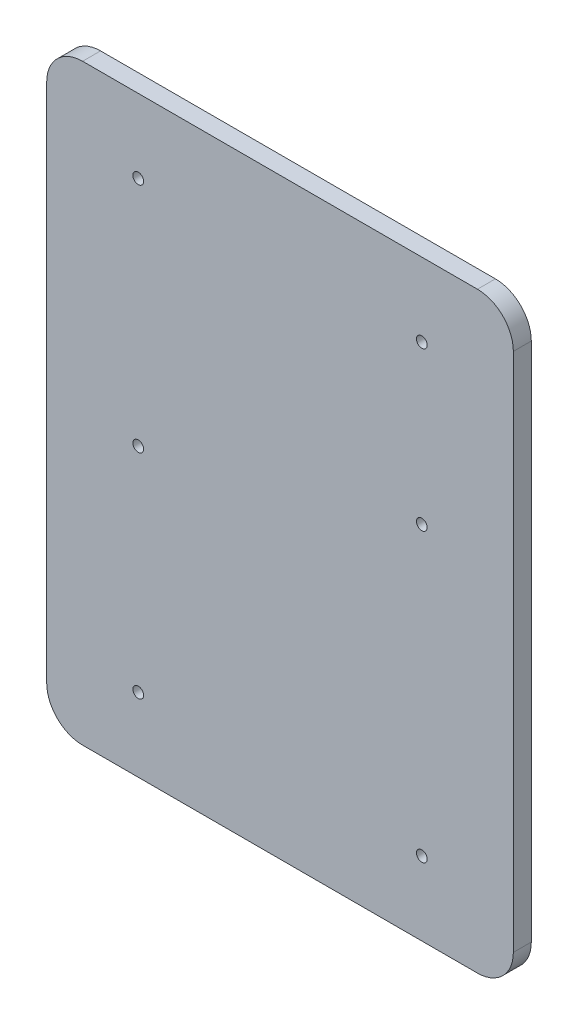
ISO-10303-21;
HEADER;
FILE_DESCRIPTION(('STEP AP214'),'2;1');
FILE_NAME('part.step','',(''),(''),'','','');
FILE_SCHEMA(('AUTOMOTIVE_DESIGN { 1 0 10303 214 1 1 1 1 }'));
ENDSEC;
DATA;
#1=APPLICATION_CONTEXT('core data for automotive mechanical design processes');
#2=APPLICATION_PROTOCOL_DEFINITION('international standard','automotive_design',2000,#1);
#3=PRODUCT_CONTEXT('',#1,'mechanical');
#4=PRODUCT('Part','Part','',(#3));
#5=PRODUCT_RELATED_PRODUCT_CATEGORY('part','',(#4));
#6=PRODUCT_DEFINITION_FORMATION('','',#4);
#7=PRODUCT_DEFINITION_CONTEXT('part definition',#1,'design');
#8=PRODUCT_DEFINITION('design','',#6,#7);
#9=PRODUCT_DEFINITION_SHAPE('','',#8);
#10=(LENGTH_UNIT() NAMED_UNIT(*) SI_UNIT(.MILLI.,.METRE.));
#11=(NAMED_UNIT(*) PLANE_ANGLE_UNIT() SI_UNIT($,.RADIAN.));
#12=(NAMED_UNIT(*) SI_UNIT($,.STERADIAN.) SOLID_ANGLE_UNIT());
#13=UNCERTAINTY_MEASURE_WITH_UNIT(LENGTH_MEASURE(1.E-05),#10,'distance_accuracy_value','');
#14=(GEOMETRIC_REPRESENTATION_CONTEXT(3) GLOBAL_UNCERTAINTY_ASSIGNED_CONTEXT((#13)) GLOBAL_UNIT_ASSIGNED_CONTEXT((#10,
#11,#12)) REPRESENTATION_CONTEXT('',''));
#15=CARTESIAN_POINT('',(0.,0.,0.));
#16=DIRECTION('',(0.,0.,1.));
#17=DIRECTION('',(1.,0.,0.));
#18=AXIS2_PLACEMENT_3D('',#15,#16,#17);
#19=CARTESIAN_POINT('',(-49.2171194490085,118.60614533863,5.));
#20=DIRECTION('',(0.,0.,-1.));
#21=DIRECTION('',(-1.,0.,0.));
#22=AXIS2_PLACEMENT_3D('',#19,#20,#21);
#23=CYLINDRICAL_SURFACE('',#22,10.);
#24=CARTESIAN_POINT('',(-49.2171194490085,118.60614533863,0.));
#25=DIRECTION('',(0.,0.,1.));
#26=DIRECTION('',(-1.,0.,0.));
#27=AXIS2_PLACEMENT_3D('',#24,#25,#26);
#28=CIRCLE('',#27,10.);
#29=CARTESIAN_POINT('',(-49.2171194490085,128.60614533863,0.));
#30=VERTEX_POINT('',#29);
#31=CARTESIAN_POINT('',(-59.2171194490085,118.60614533863,0.));
#32=VERTEX_POINT('',#31);
#33=EDGE_CURVE('E128',#30,#32,#28,.T.);
#34=ORIENTED_EDGE('',*,*,#33,.T.);
#35=DIRECTION('',(0.,0.,-1.));
#36=VECTOR('',#35,1.);
#37=CARTESIAN_POINT('',(-59.2171194490085,118.60614533863,5.));
#38=LINE('',#37,#36);
#39=CARTESIAN_POINT('',(-59.2171194490085,118.60614533863,5.));
#40=VERTEX_POINT('',#39);
#41=EDGE_CURVE('E11',#40,#32,#38,.T.);
#42=ORIENTED_EDGE('',*,*,#41,.F.);
#43=CARTESIAN_POINT('',(-49.2171194490085,118.60614533863,5.));
#44=DIRECTION('',(0.,0.,1.));
#45=DIRECTION('',(-1.,0.,0.));
#46=AXIS2_PLACEMENT_3D('',#43,#44,#45);
#47=CIRCLE('',#46,10.);
#48=CARTESIAN_POINT('',(-49.2171194490085,128.60614533863,5.));
#49=VERTEX_POINT('',#48);
#50=EDGE_CURVE('E143',#49,#40,#47,.T.);
#51=ORIENTED_EDGE('',*,*,#50,.F.);
#52=DIRECTION('',(0.,0.,-1.));
#53=VECTOR('',#52,1.);
#54=CARTESIAN_POINT('',(-49.2171194490085,128.60614533863,5.));
#55=LINE('',#54,#53);
#56=EDGE_CURVE('E124',#49,#30,#55,.T.);
#57=ORIENTED_EDGE('',*,*,#56,.T.);
#58=EDGE_LOOP('',(#34,#42,#51,#57));
#59=FACE_BOUND('',#58,.T.);
#60=ADVANCED_FACE('F32',(#59),#23,.T.);
#61=CARTESIAN_POINT('',(-59.2171194490085,-26.3938546613698,5.));
#62=DIRECTION('',(1.,0.,0.));
#63=DIRECTION('',(0.,0.,-1.));
#64=AXIS2_PLACEMENT_3D('',#61,#62,#63);
#65=PLANE('',#64);
#66=DIRECTION('',(0.,-1.,0.));
#67=VECTOR('',#66,1.);
#68=CARTESIAN_POINT('',(-59.2171194490085,-26.3938546613698,0.));
#69=LINE('',#68,#67);
#70=CARTESIAN_POINT('',(-59.2171194490085,-26.3938546613698,0.));
#71=VERTEX_POINT('',#70);
#72=EDGE_CURVE('E131',#32,#71,#69,.T.);
#73=ORIENTED_EDGE('',*,*,#72,.T.);
#74=DIRECTION('',(0.,0.,-1.));
#75=VECTOR('',#74,1.);
#76=CARTESIAN_POINT('',(-59.2171194490085,-26.3938546613698,5.));
#77=LINE('',#76,#75);
#78=CARTESIAN_POINT('',(-59.2171194490085,-26.3938546613698,5.));
#79=VERTEX_POINT('',#78);
#80=EDGE_CURVE('E40',#79,#71,#77,.T.);
#81=ORIENTED_EDGE('',*,*,#80,.F.);
#82=DIRECTION('',(0.,-1.,0.));
#83=VECTOR('',#82,1.);
#84=CARTESIAN_POINT('',(-59.2171194490085,-26.3938546613698,5.));
#85=LINE('',#84,#83);
#86=EDGE_CURVE('E91',#40,#79,#85,.T.);
#87=ORIENTED_EDGE('',*,*,#86,.F.);
#88=ORIENTED_EDGE('',*,*,#41,.T.);
#89=EDGE_LOOP('',(#73,#81,#87,#88));
#90=FACE_BOUND('',#89,.T.);
#91=ADVANCED_FACE('F243',(#90),#65,.F.);
#92=CARTESIAN_POINT('',(-49.2171194490085,-26.3938546613698,5.));
#93=DIRECTION('',(0.,0.,-1.));
#94=DIRECTION('',(-1.,0.,0.));
#95=AXIS2_PLACEMENT_3D('',#92,#93,#94);
#96=CYLINDRICAL_SURFACE('',#95,10.);
#97=CARTESIAN_POINT('',(-49.2171194490085,-26.3938546613698,0.));
#98=DIRECTION('',(0.,0.,1.));
#99=DIRECTION('',(-1.,0.,0.));
#100=AXIS2_PLACEMENT_3D('',#97,#98,#99);
#101=CIRCLE('',#100,10.);
#102=CARTESIAN_POINT('',(-49.2171194490085,-36.3938546613698,0.));
#103=VERTEX_POINT('',#102);
#104=EDGE_CURVE('E134',#71,#103,#101,.T.);
#105=ORIENTED_EDGE('',*,*,#104,.T.);
#106=DIRECTION('',(0.,0.,-1.));
#107=VECTOR('',#106,1.);
#108=CARTESIAN_POINT('',(-49.2171194490085,-36.3938546613698,5.));
#109=LINE('',#108,#107);
#110=CARTESIAN_POINT('',(-49.2171194490085,-36.3938546613698,5.));
#111=VERTEX_POINT('',#110);
#112=EDGE_CURVE('E150',#111,#103,#109,.T.);
#113=ORIENTED_EDGE('',*,*,#112,.F.);
#114=CARTESIAN_POINT('',(-49.2171194490085,-26.3938546613698,5.));
#115=DIRECTION('',(0.,0.,1.));
#116=DIRECTION('',(-1.,0.,0.));
#117=AXIS2_PLACEMENT_3D('',#114,#115,#116);
#118=CIRCLE('',#117,10.);
#119=EDGE_CURVE('E158',#79,#111,#118,.T.);
#120=ORIENTED_EDGE('',*,*,#119,.F.);
#121=ORIENTED_EDGE('',*,*,#80,.T.);
#122=EDGE_LOOP('',(#105,#113,#120,#121));
#123=FACE_BOUND('',#122,.T.);
#124=ADVANCED_FACE('F156',(#123),#96,.T.);
#125=CARTESIAN_POINT('',(-49.2171194490085,-36.3938546613698,5.));
#126=DIRECTION('',(0.,1.,0.));
#127=DIRECTION('',(0.,0.,1.));
#128=AXIS2_PLACEMENT_3D('',#125,#126,#127);
#129=PLANE('',#128);
#130=DIRECTION('',(1.,0.,0.));
#131=VECTOR('',#130,1.);
#132=CARTESIAN_POINT('',(-49.2171194490085,-36.3938546613698,0.));
#133=LINE('',#132,#131);
#134=CARTESIAN_POINT('',(60.7828805509914,-36.3938546613698,0.));
#135=VERTEX_POINT('',#134);
#136=EDGE_CURVE('E136',#103,#135,#133,.T.);
#137=ORIENTED_EDGE('',*,*,#136,.T.);
#138=DIRECTION('',(0.,0.,-1.));
#139=VECTOR('',#138,1.);
#140=CARTESIAN_POINT('',(60.7828805509914,-36.3938546613698,5.));
#141=LINE('',#140,#139);
#142=CARTESIAN_POINT('',(60.7828805509914,-36.3938546613698,5.));
#143=VERTEX_POINT('',#142);
#144=EDGE_CURVE('E147',#143,#135,#141,.T.);
#145=ORIENTED_EDGE('',*,*,#144,.F.);
#146=DIRECTION('',(1.,0.,0.));
#147=VECTOR('',#146,1.);
#148=CARTESIAN_POINT('',(-49.2171194490085,-36.3938546613698,5.));
#149=LINE('',#148,#147);
#150=EDGE_CURVE('E170',#111,#143,#149,.T.);
#151=ORIENTED_EDGE('',*,*,#150,.F.);
#152=ORIENTED_EDGE('',*,*,#112,.T.);
#153=EDGE_LOOP('',(#137,#145,#151,#152));
#154=FACE_BOUND('',#153,.T.);
#155=ADVANCED_FACE('F166',(#154),#129,.F.);
#156=CARTESIAN_POINT('',(60.7828805509915,-26.3938546613698,5.));
#157=DIRECTION('',(0.,0.,-1.));
#158=DIRECTION('',(-1.,0.,0.));
#159=AXIS2_PLACEMENT_3D('',#156,#157,#158);
#160=CYLINDRICAL_SURFACE('',#159,10.);
#161=CARTESIAN_POINT('',(60.7828805509915,-26.3938546613698,0.));
#162=DIRECTION('',(0.,0.,1.));
#163=DIRECTION('',(1.,0.,0.));
#164=AXIS2_PLACEMENT_3D('',#161,#162,#163);
#165=CIRCLE('',#164,10.);
#166=CARTESIAN_POINT('',(70.7828805509915,-26.3938546613698,0.));
#167=VERTEX_POINT('',#166);
#168=EDGE_CURVE('E138',#135,#167,#165,.T.);
#169=ORIENTED_EDGE('',*,*,#168,.T.);
#170=DIRECTION('',(0.,0.,-1.));
#171=VECTOR('',#170,1.);
#172=CARTESIAN_POINT('',(70.7828805509915,-26.3938546613698,5.));
#173=LINE('',#172,#171);
#174=CARTESIAN_POINT('',(70.7828805509915,-26.3938546613698,5.));
#175=VERTEX_POINT('',#174);
#176=EDGE_CURVE('E119',#175,#167,#173,.T.);
#177=ORIENTED_EDGE('',*,*,#176,.F.);
#178=CARTESIAN_POINT('',(60.7828805509915,-26.3938546613698,5.));
#179=DIRECTION('',(0.,0.,1.));
#180=DIRECTION('',(1.,0.,0.));
#181=AXIS2_PLACEMENT_3D('',#178,#179,#180);
#182=CIRCLE('',#181,10.);
#183=EDGE_CURVE('E110',#143,#175,#182,.T.);
#184=ORIENTED_EDGE('',*,*,#183,.F.);
#185=ORIENTED_EDGE('',*,*,#144,.T.);
#186=EDGE_LOOP('',(#169,#177,#184,#185));
#187=FACE_BOUND('',#186,.T.);
#188=ADVANCED_FACE('F169',(#187),#160,.T.);
#189=CARTESIAN_POINT('',(70.7828805509915,-26.3938546613698,5.));
#190=DIRECTION('',(-1.,0.,0.));
#191=DIRECTION('',(0.,0.,1.));
#192=AXIS2_PLACEMENT_3D('',#189,#190,#191);
#193=PLANE('',#192);
#194=DIRECTION('',(0.,1.,0.));
#195=VECTOR('',#194,1.);
#196=CARTESIAN_POINT('',(70.7828805509915,-26.3938546613698,0.));
#197=LINE('',#196,#195);
#198=CARTESIAN_POINT('',(70.7828805509915,118.60614533863,0.));
#199=VERTEX_POINT('',#198);
#200=EDGE_CURVE('E118',#167,#199,#197,.T.);
#201=ORIENTED_EDGE('',*,*,#200,.T.);
#202=DIRECTION('',(0.,0.,-1.));
#203=VECTOR('',#202,1.);
#204=CARTESIAN_POINT('',(70.7828805509915,118.60614533863,5.));
#205=LINE('',#204,#203);
#206=CARTESIAN_POINT('',(70.7828805509915,118.60614533863,5.));
#207=VERTEX_POINT('',#206);
#208=EDGE_CURVE('E115',#207,#199,#205,.T.);
#209=ORIENTED_EDGE('',*,*,#208,.F.);
#210=DIRECTION('',(0.,1.,0.));
#211=VECTOR('',#210,1.);
#212=CARTESIAN_POINT('',(70.7828805509915,-26.3938546613698,5.));
#213=LINE('',#212,#211);
#214=EDGE_CURVE('E104',#175,#207,#213,.T.);
#215=ORIENTED_EDGE('',*,*,#214,.F.);
#216=ORIENTED_EDGE('',*,*,#176,.T.);
#217=EDGE_LOOP('',(#201,#209,#215,#216));
#218=FACE_BOUND('',#217,.T.);
#219=ADVANCED_FACE('F116',(#218),#193,.F.);
#220=CARTESIAN_POINT('',(60.7828805509915,118.60614533863,5.));
#221=DIRECTION('',(0.,0.,-1.));
#222=DIRECTION('',(-1.,0.,0.));
#223=AXIS2_PLACEMENT_3D('',#220,#221,#222);
#224=CYLINDRICAL_SURFACE('',#223,10.);
#225=CARTESIAN_POINT('',(60.7828805509915,118.60614533863,0.));
#226=DIRECTION('',(0.,0.,1.));
#227=DIRECTION('',(-1.,0.,0.));
#228=AXIS2_PLACEMENT_3D('',#225,#226,#227);
#229=CIRCLE('',#228,10.);
#230=CARTESIAN_POINT('',(60.7828805509914,128.60614533863,0.));
#231=VERTEX_POINT('',#230);
#232=EDGE_CURVE('E77',#199,#231,#229,.T.);
#233=ORIENTED_EDGE('',*,*,#232,.T.);
#234=DIRECTION('',(0.,0.,-1.));
#235=VECTOR('',#234,1.);
#236=CARTESIAN_POINT('',(60.7828805509914,128.60614533863,5.));
#237=LINE('',#236,#235);
#238=CARTESIAN_POINT('',(60.7828805509914,128.60614533863,5.));
#239=VERTEX_POINT('',#238);
#240=EDGE_CURVE('E120',#239,#231,#237,.T.);
#241=ORIENTED_EDGE('',*,*,#240,.F.);
#242=CARTESIAN_POINT('',(60.7828805509915,118.60614533863,5.));
#243=DIRECTION('',(0.,0.,1.));
#244=DIRECTION('',(-1.,0.,0.));
#245=AXIS2_PLACEMENT_3D('',#242,#243,#244);
#246=CIRCLE('',#245,10.);
#247=EDGE_CURVE('E108',#207,#239,#246,.T.);
#248=ORIENTED_EDGE('',*,*,#247,.F.);
#249=ORIENTED_EDGE('',*,*,#208,.T.);
#250=EDGE_LOOP('',(#233,#241,#248,#249));
#251=FACE_BOUND('',#250,.T.);
#252=ADVANCED_FACE('F122',(#251),#224,.T.);
#253=CARTESIAN_POINT('',(-49.2171194490085,128.60614533863,5.));
#254=DIRECTION('',(0.,-1.,0.));
#255=DIRECTION('',(0.,0.,-1.));
#256=AXIS2_PLACEMENT_3D('',#253,#254,#255);
#257=PLANE('',#256);
#258=DIRECTION('',(-1.,0.,0.));
#259=VECTOR('',#258,1.);
#260=CARTESIAN_POINT('',(-49.2171194490085,128.60614533863,0.));
#261=LINE('',#260,#259);
#262=EDGE_CURVE('E83',#231,#30,#261,.T.);
#263=ORIENTED_EDGE('',*,*,#262,.T.);
#264=ORIENTED_EDGE('',*,*,#56,.F.);
#265=DIRECTION('',(-1.,0.,0.));
#266=VECTOR('',#265,1.);
#267=CARTESIAN_POINT('',(-49.2171194490085,128.60614533863,5.));
#268=LINE('',#267,#266);
#269=EDGE_CURVE('E48',#239,#49,#268,.T.);
#270=ORIENTED_EDGE('',*,*,#269,.F.);
#271=ORIENTED_EDGE('',*,*,#240,.T.);
#272=EDGE_LOOP('',(#263,#264,#270,#271));
#273=FACE_BOUND('',#272,.T.);
#274=ADVANCED_FACE('F250',(#273),#257,.F.);
#275=CARTESIAN_POINT('',(-49.2171194490085,118.60614533863,5.));
#276=DIRECTION('',(0.,0.,-1.));
#277=DIRECTION('',(-1.,0.,0.));
#278=AXIS2_PLACEMENT_3D('',#275,#276,#277);
#279=PLANE('',#278);
#280=CARTESIAN_POINT('',(45.2828805509915,64.1061453386302,5.));
#281=DIRECTION('',(0.,0.,-1.));
#282=DIRECTION('',(-1.,0.,0.));
#283=AXIS2_PLACEMENT_3D('',#280,#281,#282);
#284=CIRCLE('',#283,1.5);
#285=CARTESIAN_POINT('',(43.7828805509915,64.1061453386302,5.));
#286=VERTEX_POINT('',#285);
#287=EDGE_CURVE('E203',#286,#286,#284,.T.);
#288=ORIENTED_EDGE('',*,*,#287,.T.);
#289=EDGE_LOOP('',(#288));
#290=FACE_BOUND('',#289,.T.);
#291=CARTESIAN_POINT('',(-33.7171194490085,43.5061453386302,5.));
#292=DIRECTION('',(0.,0.,-1.));
#293=DIRECTION('',(-1.,0.,0.));
#294=AXIS2_PLACEMENT_3D('',#291,#292,#293);
#295=CIRCLE('',#294,1.5);
#296=CARTESIAN_POINT('',(-35.2171194490085,43.5061453386302,5.));
#297=VERTEX_POINT('',#296);
#298=EDGE_CURVE('E186',#297,#297,#295,.T.);
#299=ORIENTED_EDGE('',*,*,#298,.T.);
#300=EDGE_LOOP('',(#299));
#301=FACE_BOUND('',#300,.T.);
#302=CARTESIAN_POINT('',(-33.7171194490085,108.10614533863,5.));
#303=DIRECTION('',(0.,0.,-1.));
#304=DIRECTION('',(-1.,0.,0.));
#305=AXIS2_PLACEMENT_3D('',#302,#303,#304);
#306=CIRCLE('',#305,1.5);
#307=CARTESIAN_POINT('',(-35.2171194490085,108.10614533863,5.));
#308=VERTEX_POINT('',#307);
#309=EDGE_CURVE('E179',#308,#308,#306,.T.);
#310=ORIENTED_EDGE('',*,*,#309,.T.);
#311=EDGE_LOOP('',(#310));
#312=FACE_BOUND('',#311,.T.);
#313=CARTESIAN_POINT('',(45.2828805509915,-15.8938546613698,5.));
#314=DIRECTION('',(0.,0.,-1.));
#315=DIRECTION('',(-1.,0.,0.));
#316=AXIS2_PLACEMENT_3D('',#313,#314,#315);
#317=CIRCLE('',#316,1.5);
#318=CARTESIAN_POINT('',(43.7828805509915,-15.8938546613698,5.));
#319=VERTEX_POINT('',#318);
#320=EDGE_CURVE('E192',#319,#319,#317,.T.);
#321=ORIENTED_EDGE('',*,*,#320,.T.);
#322=EDGE_LOOP('',(#321));
#323=FACE_BOUND('',#322,.T.);
#324=CARTESIAN_POINT('',(45.2828805509915,108.10614533863,5.));
#325=DIRECTION('',(0.,0.,-1.));
#326=DIRECTION('',(-1.,0.,0.));
#327=AXIS2_PLACEMENT_3D('',#324,#325,#326);
#328=CIRCLE('',#327,1.5);
#329=CARTESIAN_POINT('',(43.7828805509915,108.10614533863,5.));
#330=VERTEX_POINT('',#329);
#331=EDGE_CURVE('E185',#330,#330,#328,.T.);
#332=ORIENTED_EDGE('',*,*,#331,.T.);
#333=EDGE_LOOP('',(#332));
#334=FACE_BOUND('',#333,.T.);
#335=CARTESIAN_POINT('',(-33.7171194490085,-15.8938546613698,5.));
#336=DIRECTION('',(0.,0.,-1.));
#337=DIRECTION('',(-1.,0.,0.));
#338=AXIS2_PLACEMENT_3D('',#335,#336,#337);
#339=CIRCLE('',#338,1.5);
#340=CARTESIAN_POINT('',(-35.2171194490085,-15.8938546613698,5.));
#341=VERTEX_POINT('',#340);
#342=EDGE_CURVE('E132',#341,#341,#339,.T.);
#343=ORIENTED_EDGE('',*,*,#342,.T.);
#344=EDGE_LOOP('',(#343));
#345=FACE_BOUND('',#344,.T.);
#346=ORIENTED_EDGE('',*,*,#50,.T.);
#347=ORIENTED_EDGE('',*,*,#86,.T.);
#348=ORIENTED_EDGE('',*,*,#119,.T.);
#349=ORIENTED_EDGE('',*,*,#150,.T.);
#350=ORIENTED_EDGE('',*,*,#183,.T.);
#351=ORIENTED_EDGE('',*,*,#214,.T.);
#352=ORIENTED_EDGE('',*,*,#247,.T.);
#353=ORIENTED_EDGE('',*,*,#269,.T.);
#354=EDGE_LOOP('',(#346,#347,#348,#349,#350,#351,#352,#353));
#355=FACE_BOUND('',#354,.T.);
#356=ADVANCED_FACE('F106',(#290,#301,#312,#323,#334,#345,#355),#279,.F.);
#357=CARTESIAN_POINT('',(-49.2171194490085,118.60614533863,0.));
#358=DIRECTION('',(0.,0.,-1.));
#359=DIRECTION('',(-1.,0.,0.));
#360=AXIS2_PLACEMENT_3D('',#357,#358,#359);
#361=PLANE('',#360);
#362=CARTESIAN_POINT('',(45.2828805509915,64.1061453386302,0.));
#363=DIRECTION('',(0.,0.,-1.));
#364=DIRECTION('',(-1.,0.,0.));
#365=AXIS2_PLACEMENT_3D('',#362,#363,#364);
#366=CIRCLE('',#365,1.5);
#367=CARTESIAN_POINT('',(43.7828805509915,64.1061453386302,0.));
#368=VERTEX_POINT('',#367);
#369=EDGE_CURVE('E208',#368,#368,#366,.T.);
#370=ORIENTED_EDGE('',*,*,#369,.F.);
#371=EDGE_LOOP('',(#370));
#372=FACE_BOUND('',#371,.T.);
#373=CARTESIAN_POINT('',(-33.7171194490085,43.5061453386302,0.));
#374=DIRECTION('',(0.,0.,-1.));
#375=DIRECTION('',(-1.,0.,0.));
#376=AXIS2_PLACEMENT_3D('',#373,#374,#375);
#377=CIRCLE('',#376,1.5);
#378=CARTESIAN_POINT('',(-35.2171194490085,43.5061453386302,0.));
#379=VERTEX_POINT('',#378);
#380=EDGE_CURVE('E200',#379,#379,#377,.T.);
#381=ORIENTED_EDGE('',*,*,#380,.F.);
#382=EDGE_LOOP('',(#381));
#383=FACE_BOUND('',#382,.T.);
#384=CARTESIAN_POINT('',(-33.7171194490085,108.10614533863,0.));
#385=DIRECTION('',(0.,0.,-1.));
#386=DIRECTION('',(-1.,0.,0.));
#387=AXIS2_PLACEMENT_3D('',#384,#385,#386);
#388=CIRCLE('',#387,1.5);
#389=CARTESIAN_POINT('',(-35.2171194490085,108.10614533863,0.));
#390=VERTEX_POINT('',#389);
#391=EDGE_CURVE('E195',#390,#390,#388,.T.);
#392=ORIENTED_EDGE('',*,*,#391,.F.);
#393=EDGE_LOOP('',(#392));
#394=FACE_BOUND('',#393,.T.);
#395=CARTESIAN_POINT('',(45.2828805509915,-15.8938546613698,0.));
#396=DIRECTION('',(0.,0.,-1.));
#397=DIRECTION('',(-1.,0.,0.));
#398=AXIS2_PLACEMENT_3D('',#395,#396,#397);
#399=CIRCLE('',#398,1.5);
#400=CARTESIAN_POINT('',(43.7828805509915,-15.8938546613698,0.));
#401=VERTEX_POINT('',#400);
#402=EDGE_CURVE('E189',#401,#401,#399,.T.);
#403=ORIENTED_EDGE('',*,*,#402,.F.);
#404=EDGE_LOOP('',(#403));
#405=FACE_BOUND('',#404,.T.);
#406=CARTESIAN_POINT('',(45.2828805509915,108.10614533863,0.));
#407=DIRECTION('',(0.,0.,-1.));
#408=DIRECTION('',(-1.,0.,0.));
#409=AXIS2_PLACEMENT_3D('',#406,#407,#408);
#410=CIRCLE('',#409,1.5);
#411=CARTESIAN_POINT('',(43.7828805509915,108.10614533863,0.));
#412=VERTEX_POINT('',#411);
#413=EDGE_CURVE('E182',#412,#412,#410,.T.);
#414=ORIENTED_EDGE('',*,*,#413,.F.);
#415=EDGE_LOOP('',(#414));
#416=FACE_BOUND('',#415,.T.);
#417=CARTESIAN_POINT('',(-33.7171194490085,-15.8938546613698,0.));
#418=DIRECTION('',(0.,0.,-1.));
#419=DIRECTION('',(-1.,0.,0.));
#420=AXIS2_PLACEMENT_3D('',#417,#418,#419);
#421=CIRCLE('',#420,1.5);
#422=CARTESIAN_POINT('',(-35.2171194490085,-15.8938546613698,0.));
#423=VERTEX_POINT('',#422);
#424=EDGE_CURVE('E176',#423,#423,#421,.T.);
#425=ORIENTED_EDGE('',*,*,#424,.F.);
#426=EDGE_LOOP('',(#425));
#427=FACE_BOUND('',#426,.T.);
#428=ORIENTED_EDGE('',*,*,#33,.F.);
#429=ORIENTED_EDGE('',*,*,#262,.F.);
#430=ORIENTED_EDGE('',*,*,#232,.F.);
#431=ORIENTED_EDGE('',*,*,#200,.F.);
#432=ORIENTED_EDGE('',*,*,#168,.F.);
#433=ORIENTED_EDGE('',*,*,#136,.F.);
#434=ORIENTED_EDGE('',*,*,#104,.F.);
#435=ORIENTED_EDGE('',*,*,#72,.F.);
#436=EDGE_LOOP('',(#428,#429,#430,#431,#432,#433,#434,#435));
#437=FACE_BOUND('',#436,.T.);
#438=ADVANCED_FACE('F162',(#372,#383,#394,#405,#416,#427,#437),#361,.T.);
#439=CARTESIAN_POINT('',(-33.7171194490085,-15.8938546613698,5.));
#440=DIRECTION('',(0.,0.,-1.));
#441=DIRECTION('',(-1.,0.,0.));
#442=AXIS2_PLACEMENT_3D('',#439,#440,#441);
#443=CYLINDRICAL_SURFACE('',#442,1.5);
#444=ORIENTED_EDGE('',*,*,#342,.F.);
#445=EDGE_LOOP('',(#444));
#446=FACE_BOUND('',#445,.T.);
#447=ORIENTED_EDGE('',*,*,#424,.T.);
#448=EDGE_LOOP('',(#447));
#449=FACE_BOUND('',#448,.T.);
#450=ADVANCED_FACE('F217',(#446,#449),#443,.F.);
#451=CARTESIAN_POINT('',(45.2828805509915,108.10614533863,5.));
#452=DIRECTION('',(0.,0.,-1.));
#453=DIRECTION('',(-1.,0.,0.));
#454=AXIS2_PLACEMENT_3D('',#451,#452,#453);
#455=CYLINDRICAL_SURFACE('',#454,1.5);
#456=ORIENTED_EDGE('',*,*,#331,.F.);
#457=EDGE_LOOP('',(#456));
#458=FACE_BOUND('',#457,.T.);
#459=ORIENTED_EDGE('',*,*,#413,.T.);
#460=EDGE_LOOP('',(#459));
#461=FACE_BOUND('',#460,.T.);
#462=ADVANCED_FACE('F230',(#458,#461),#455,.F.);
#463=CARTESIAN_POINT('',(45.2828805509915,-15.8938546613698,5.));
#464=DIRECTION('',(0.,0.,-1.));
#465=DIRECTION('',(-1.,0.,0.));
#466=AXIS2_PLACEMENT_3D('',#463,#464,#465);
#467=CYLINDRICAL_SURFACE('',#466,1.5);
#468=ORIENTED_EDGE('',*,*,#320,.F.);
#469=EDGE_LOOP('',(#468));
#470=FACE_BOUND('',#469,.T.);
#471=ORIENTED_EDGE('',*,*,#402,.T.);
#472=EDGE_LOOP('',(#471));
#473=FACE_BOUND('',#472,.T.);
#474=ADVANCED_FACE('F237',(#470,#473),#467,.F.);
#475=CARTESIAN_POINT('',(-33.7171194490085,108.10614533863,5.));
#476=DIRECTION('',(0.,0.,-1.));
#477=DIRECTION('',(-1.,0.,0.));
#478=AXIS2_PLACEMENT_3D('',#475,#476,#477);
#479=CYLINDRICAL_SURFACE('',#478,1.5);
#480=ORIENTED_EDGE('',*,*,#309,.F.);
#481=EDGE_LOOP('',(#480));
#482=FACE_BOUND('',#481,.T.);
#483=ORIENTED_EDGE('',*,*,#391,.T.);
#484=EDGE_LOOP('',(#483));
#485=FACE_BOUND('',#484,.T.);
#486=ADVANCED_FACE('F313',(#482,#485),#479,.F.);
#487=CARTESIAN_POINT('',(-33.7171194490085,43.5061453386302,5.));
#488=DIRECTION('',(0.,0.,-1.));
#489=DIRECTION('',(-1.,0.,0.));
#490=AXIS2_PLACEMENT_3D('',#487,#488,#489);
#491=CYLINDRICAL_SURFACE('',#490,1.5);
#492=ORIENTED_EDGE('',*,*,#298,.F.);
#493=EDGE_LOOP('',(#492));
#494=FACE_BOUND('',#493,.T.);
#495=ORIENTED_EDGE('',*,*,#380,.T.);
#496=EDGE_LOOP('',(#495));
#497=FACE_BOUND('',#496,.T.);
#498=ADVANCED_FACE('F323',(#494,#497),#491,.F.);
#499=CARTESIAN_POINT('',(45.2828805509915,64.1061453386302,10.));
#500=DIRECTION('',(0.,0.,-1.));
#501=DIRECTION('',(-1.,0.,0.));
#502=AXIS2_PLACEMENT_3D('',#499,#500,#501);
#503=CYLINDRICAL_SURFACE('',#502,1.5);
#504=ORIENTED_EDGE('',*,*,#369,.T.);
#505=EDGE_LOOP('',(#504));
#506=FACE_BOUND('',#505,.T.);
#507=ORIENTED_EDGE('',*,*,#287,.F.);
#508=EDGE_LOOP('',(#507));
#509=FACE_BOUND('',#508,.T.);
#510=ADVANCED_FACE('F212',(#506,#509),#503,.F.);
#511=CLOSED_SHELL('',(#60,#91,#124,#155,#188,#219,#252,#274,#356,#438,#450,#462,#474,#486,#498,#510));
#512=MANIFOLD_SOLID_BREP('B2',#511);
#513=ADVANCED_BREP_SHAPE_REPRESENTATION('',(#18,#512),#14);
#514=SHAPE_DEFINITION_REPRESENTATION(#9,#513);
ENDSEC;
END-ISO-10303-21;
